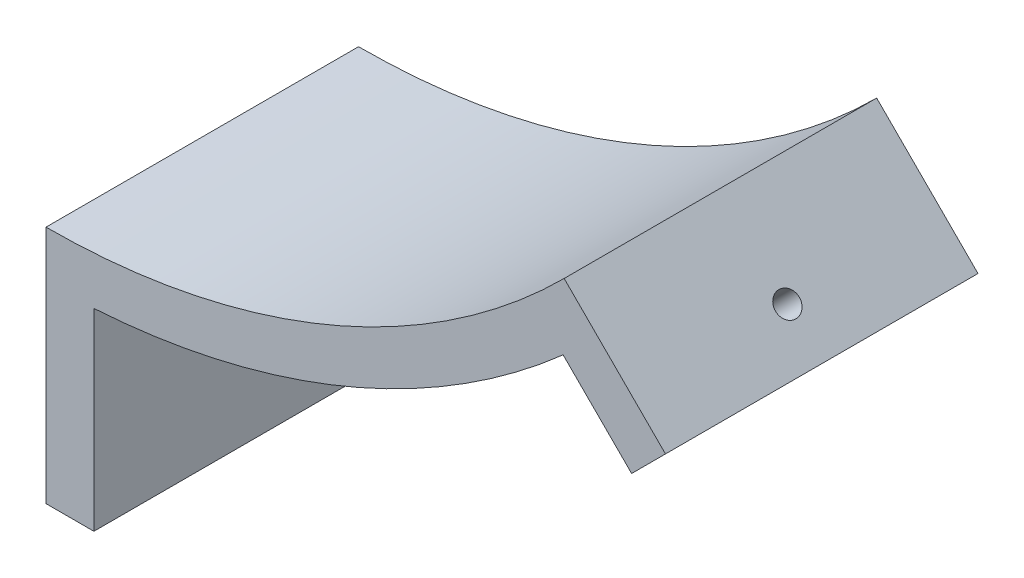
ISO-10303-21;
HEADER;
FILE_DESCRIPTION(('STEP AP214'),'2;1');
FILE_NAME('part.step','',(''),(''),'','','');
FILE_SCHEMA(('AUTOMOTIVE_DESIGN { 1 0 10303 214 1 1 1 1 }'));
ENDSEC;
DATA;
#1=APPLICATION_CONTEXT('core data for automotive mechanical design processes');
#2=APPLICATION_PROTOCOL_DEFINITION('international standard','automotive_design',2000,#1);
#3=PRODUCT_CONTEXT('',#1,'mechanical');
#4=PRODUCT('Part','Part','',(#3));
#5=PRODUCT_RELATED_PRODUCT_CATEGORY('part','',(#4));
#6=PRODUCT_DEFINITION_FORMATION('','',#4);
#7=PRODUCT_DEFINITION_CONTEXT('part definition',#1,'design');
#8=PRODUCT_DEFINITION('design','',#6,#7);
#9=PRODUCT_DEFINITION_SHAPE('','',#8);
#10=(LENGTH_UNIT() NAMED_UNIT(*) SI_UNIT(.MILLI.,.METRE.));
#11=(NAMED_UNIT(*) PLANE_ANGLE_UNIT() SI_UNIT($,.RADIAN.));
#12=(NAMED_UNIT(*) SI_UNIT($,.STERADIAN.) SOLID_ANGLE_UNIT());
#13=UNCERTAINTY_MEASURE_WITH_UNIT(LENGTH_MEASURE(1.E-05),#10,'distance_accuracy_value','');
#14=(GEOMETRIC_REPRESENTATION_CONTEXT(3) GLOBAL_UNCERTAINTY_ASSIGNED_CONTEXT((#13)) GLOBAL_UNIT_ASSIGNED_CONTEXT((#10,
#11,#12)) REPRESENTATION_CONTEXT('',''));
#15=CARTESIAN_POINT('',(0.,0.,0.));
#16=DIRECTION('',(0.,0.,1.));
#17=DIRECTION('',(1.,0.,0.));
#18=AXIS2_PLACEMENT_3D('',#15,#16,#17);
#19=CARTESIAN_POINT('',(9.99999999999998,0.,65.25));
#20=DIRECTION('',(-1.,0.,0.));
#21=DIRECTION('',(0.,-1.,0.));
#22=AXIS2_PLACEMENT_3D('',#19,#20,#21);
#23=PLANE('',#22);
#24=CARTESIAN_POINT('',(9.99999999999998,-183.,32.625));
#25=DIRECTION('',(1.,0.,0.));
#26=DIRECTION('',(0.,0.,-1.));
#27=AXIS2_PLACEMENT_3D('',#24,#25,#26);
#28=CIRCLE('',#27,2.5);
#29=CARTESIAN_POINT('',(9.99999999999998,-183.,30.125));
#30=VERTEX_POINT('',#29);
#31=EDGE_CURVE('E179',#30,#30,#28,.T.);
#32=ORIENTED_EDGE('',*,*,#31,.F.);
#33=EDGE_LOOP('',(#32));
#34=FACE_BOUND('',#33,.T.);
#35=DIRECTION('',(0.,1.,0.));
#36=VECTOR('',#35,1.);
#37=CARTESIAN_POINT('',(9.99999999999998,0.,0.));
#38=LINE('',#37,#36);
#39=CARTESIAN_POINT('',(10.,-203.,0.));
#40=VERTEX_POINT('',#39);
#41=CARTESIAN_POINT('',(10.,-162.692962355475,0.));
#42=VERTEX_POINT('',#41);
#43=EDGE_CURVE('E133',#40,#42,#38,.T.);
#44=ORIENTED_EDGE('',*,*,#43,.T.);
#45=DIRECTION('',(0.,0.,-1.));
#46=VECTOR('',#45,1.);
#47=CARTESIAN_POINT('',(10.,-162.692962355475,65.25));
#48=LINE('',#47,#46);
#49=CARTESIAN_POINT('',(10.,-162.692962355475,65.25));
#50=VERTEX_POINT('',#49);
#51=EDGE_CURVE('E11',#50,#42,#48,.T.);
#52=ORIENTED_EDGE('',*,*,#51,.F.);
#53=DIRECTION('',(0.,1.,0.));
#54=VECTOR('',#53,1.);
#55=CARTESIAN_POINT('',(9.99999999999998,0.,65.25));
#56=LINE('',#55,#54);
#57=CARTESIAN_POINT('',(10.,-203.,65.25));
#58=VERTEX_POINT('',#57);
#59=EDGE_CURVE('E151',#58,#50,#56,.T.);
#60=ORIENTED_EDGE('',*,*,#59,.F.);
#61=DIRECTION('',(0.,0.,-1.));
#62=VECTOR('',#61,1.);
#63=CARTESIAN_POINT('',(10.,-203.,65.25));
#64=LINE('',#63,#62);
#65=EDGE_CURVE('E132',#58,#40,#64,.T.);
#66=ORIENTED_EDGE('',*,*,#65,.T.);
#67=EDGE_LOOP('',(#44,#52,#60,#66));
#68=FACE_BOUND('',#67,.T.);
#69=ADVANCED_FACE('F34',(#34,#68),#23,.F.);
#70=CARTESIAN_POINT('',(0.,0.,65.25));
#71=DIRECTION('',(0.,0.,-1.));
#72=DIRECTION('',(-1.,0.,0.));
#73=AXIS2_PLACEMENT_3D('',#70,#71,#72);
#74=CYLINDRICAL_SURFACE('',#73,163.);
#75=CARTESIAN_POINT('',(0.,0.,0.));
#76=DIRECTION('',(0.,0.,1.));
#77=DIRECTION('',(1.,0.,0.));
#78=AXIS2_PLACEMENT_3D('',#75,#76,#77);
#79=CIRCLE('',#78,163.);
#80=CARTESIAN_POINT('',(107.970229121018,-122.11236474475,0.));
#81=VERTEX_POINT('',#80);
#82=EDGE_CURVE('E136',#42,#81,#79,.T.);
#83=ORIENTED_EDGE('',*,*,#82,.T.);
#84=DIRECTION('',(0.,0.,-1.));
#85=VECTOR('',#84,1.);
#86=CARTESIAN_POINT('',(107.970229121018,-122.11236474475,65.25));
#87=LINE('',#86,#85);
#88=CARTESIAN_POINT('',(107.970229121018,-122.11236474475,65.25));
#89=VERTEX_POINT('',#88);
#90=EDGE_CURVE('E43',#89,#81,#87,.T.);
#91=ORIENTED_EDGE('',*,*,#90,.F.);
#92=CARTESIAN_POINT('',(0.,0.,65.25));
#93=DIRECTION('',(0.,0.,1.));
#94=DIRECTION('',(1.,0.,0.));
#95=AXIS2_PLACEMENT_3D('',#92,#93,#94);
#96=CIRCLE('',#95,163.);
#97=EDGE_CURVE('E93',#50,#89,#96,.T.);
#98=ORIENTED_EDGE('',*,*,#97,.F.);
#99=ORIENTED_EDGE('',*,*,#51,.T.);
#100=EDGE_LOOP('',(#83,#91,#98,#99));
#101=FACE_BOUND('',#100,.T.);
#102=ADVANCED_FACE('F165',(#101),#74,.T.);
#103=CARTESIAN_POINT('',(-7.07106781186535,-7.07106781186532,65.25));
#104=DIRECTION('',(-0.707106781186549,-0.707106781186546,0.));
#105=DIRECTION('',(0.707106781186546,-0.707106781186549,0.));
#106=AXIS2_PLACEMENT_3D('',#103,#104,#105);
#107=PLANE('',#106);
#108=CARTESIAN_POINT('',(115.094553721994,-129.236689345725,32.62));
#109=DIRECTION('',(-0.707106781186549,-0.707106781186546,0.));
#110=DIRECTION('',(0.707106781186546,-0.707106781186549,0.));
#111=AXIS2_PLACEMENT_3D('',#108,#109,#110);
#112=CIRCLE('',#111,2.5);
#113=CARTESIAN_POINT('',(116.86232067496,-131.004456298691,32.62));
#114=VERTEX_POINT('',#113);
#115=EDGE_CURVE('E182',#114,#114,#112,.T.);
#116=ORIENTED_EDGE('',*,*,#115,.F.);
#117=EDGE_LOOP('',(#116));
#118=FACE_BOUND('',#117,.T.);
#119=DIRECTION('',(-0.707106781186546,0.707106781186549,0.));
#120=VECTOR('',#119,1.);
#121=CARTESIAN_POINT('',(-7.07106781186535,-7.07106781186532,0.));
#122=LINE('',#121,#120);
#123=CARTESIAN_POINT('',(122.271687551037,-136.413823174768,0.));
#124=VERTEX_POINT('',#123);
#125=EDGE_CURVE('E139',#124,#81,#122,.T.);
#126=ORIENTED_EDGE('',*,*,#125,.F.);
#127=DIRECTION('',(0.,0.,-1.));
#128=VECTOR('',#127,1.);
#129=CARTESIAN_POINT('',(122.271687551037,-136.413823174768,65.25));
#130=LINE('',#129,#128);
#131=CARTESIAN_POINT('',(122.271687551037,-136.413823174768,65.25));
#132=VERTEX_POINT('',#131);
#133=EDGE_CURVE('E157',#132,#124,#130,.T.);
#134=ORIENTED_EDGE('',*,*,#133,.F.);
#135=DIRECTION('',(-0.707106781186546,0.707106781186549,0.));
#136=VECTOR('',#135,1.);
#137=CARTESIAN_POINT('',(-7.07106781186535,-7.07106781186532,65.25));
#138=LINE('',#137,#136);
#139=EDGE_CURVE('E164',#132,#89,#138,.T.);
#140=ORIENTED_EDGE('',*,*,#139,.T.);
#141=ORIENTED_EDGE('',*,*,#90,.T.);
#142=EDGE_LOOP('',(#126,#134,#140,#141));
#143=FACE_BOUND('',#142,.T.);
#144=ADVANCED_FACE('F162',(#118,#143),#107,.T.);
#145=CARTESIAN_POINT('',(129.342755362902,-129.342755362903,65.25));
#146=DIRECTION('',(0.707106781186546,-0.70710678118655,0.));
#147=DIRECTION('',(0.70710678118655,0.707106781186546,0.));
#148=AXIS2_PLACEMENT_3D('',#145,#146,#147);
#149=PLANE('',#148);
#150=DIRECTION('',(-0.70710678118655,-0.707106781186546,0.));
#151=VECTOR('',#150,1.);
#152=CARTESIAN_POINT('',(129.342755362902,-129.342755362903,0.));
#153=LINE('',#152,#151);
#154=CARTESIAN_POINT('',(129.342755362902,-129.342755362903,0.));
#155=VERTEX_POINT('',#154);
#156=EDGE_CURVE('E142',#155,#124,#153,.T.);
#157=ORIENTED_EDGE('',*,*,#156,.F.);
#158=DIRECTION('',(0.,0.,-1.));
#159=VECTOR('',#158,1.);
#160=CARTESIAN_POINT('',(129.342755362902,-129.342755362903,65.25));
#161=LINE('',#160,#159);
#162=CARTESIAN_POINT('',(129.342755362902,-129.342755362903,65.25));
#163=VERTEX_POINT('',#162);
#164=EDGE_CURVE('E155',#163,#155,#161,.T.);
#165=ORIENTED_EDGE('',*,*,#164,.F.);
#166=DIRECTION('',(-0.70710678118655,-0.707106781186546,0.));
#167=VECTOR('',#166,1.);
#168=CARTESIAN_POINT('',(129.342755362902,-129.342755362903,65.25));
#169=LINE('',#168,#167);
#170=EDGE_CURVE('E127',#163,#132,#169,.T.);
#171=ORIENTED_EDGE('',*,*,#170,.T.);
#172=ORIENTED_EDGE('',*,*,#133,.T.);
#173=EDGE_LOOP('',(#157,#165,#171,#172));
#174=FACE_BOUND('',#173,.T.);
#175=ADVANCED_FACE('F173',(#174),#149,.T.);
#176=CARTESIAN_POINT('',(0.,0.,65.25));
#177=DIRECTION('',(0.707106781186548,0.707106781186547,0.));
#178=DIRECTION('',(-0.707106781186547,0.707106781186548,0.));
#179=AXIS2_PLACEMENT_3D('',#176,#177,#178);
#180=PLANE('',#179);
#181=CARTESIAN_POINT('',(122.165621533859,-122.165621533859,32.62));
#182=DIRECTION('',(0.707106781186549,0.707106781186546,0.));
#183=DIRECTION('',(-0.707106781186546,0.707106781186549,0.));
#184=AXIS2_PLACEMENT_3D('',#181,#182,#183);
#185=CIRCLE('',#184,2.5);
#186=CARTESIAN_POINT('',(120.397854580893,-120.397854580893,32.62));
#187=VERTEX_POINT('',#186);
#188=EDGE_CURVE('E185',#187,#187,#185,.T.);
#189=ORIENTED_EDGE('',*,*,#188,.F.);
#190=EDGE_LOOP('',(#189));
#191=FACE_BOUND('',#190,.T.);
#192=DIRECTION('',(0.707106781186547,-0.707106781186548,0.));
#193=VECTOR('',#192,1.);
#194=CARTESIAN_POINT('',(0.,0.,0.));
#195=LINE('',#194,#193);
#196=CARTESIAN_POINT('',(108.187337521542,-108.187337521542,0.));
#197=VERTEX_POINT('',#196);
#198=EDGE_CURVE('E145',#197,#155,#195,.T.);
#199=ORIENTED_EDGE('',*,*,#198,.F.);
#200=DIRECTION('',(0.,0.,-1.));
#201=VECTOR('',#200,1.);
#202=CARTESIAN_POINT('',(108.187337521542,-108.187337521542,65.25));
#203=LINE('',#202,#201);
#204=CARTESIAN_POINT('',(108.187337521542,-108.187337521542,65.25));
#205=VERTEX_POINT('',#204);
#206=EDGE_CURVE('E115',#205,#197,#203,.T.);
#207=ORIENTED_EDGE('',*,*,#206,.F.);
#208=DIRECTION('',(0.707106781186547,-0.707106781186548,0.));
#209=VECTOR('',#208,1.);
#210=CARTESIAN_POINT('',(0.,0.,65.25));
#211=LINE('',#210,#209);
#212=EDGE_CURVE('E125',#205,#163,#211,.T.);
#213=ORIENTED_EDGE('',*,*,#212,.T.);
#214=ORIENTED_EDGE('',*,*,#164,.T.);
#215=EDGE_LOOP('',(#199,#207,#213,#214));
#216=FACE_BOUND('',#215,.T.);
#217=ADVANCED_FACE('F191',(#191,#216),#180,.T.);
#218=CARTESIAN_POINT('',(0.,0.,65.25));
#219=DIRECTION('',(0.,0.,-1.));
#220=DIRECTION('',(-1.,0.,0.));
#221=AXIS2_PLACEMENT_3D('',#218,#219,#220);
#222=CYLINDRICAL_SURFACE('',#221,153.);
#223=CARTESIAN_POINT('',(0.,0.,0.));
#224=DIRECTION('',(0.,0.,1.));
#225=DIRECTION('',(1.,0.,0.));
#226=AXIS2_PLACEMENT_3D('',#223,#224,#225);
#227=CIRCLE('',#226,153.);
#228=CARTESIAN_POINT('',(0.,-153.,0.));
#229=VERTEX_POINT('',#228);
#230=EDGE_CURVE('E114',#229,#197,#227,.T.);
#231=ORIENTED_EDGE('',*,*,#230,.F.);
#232=DIRECTION('',(0.,0.,-1.));
#233=VECTOR('',#232,1.);
#234=CARTESIAN_POINT('',(0.,-153.,65.25));
#235=LINE('',#234,#233);
#236=CARTESIAN_POINT('',(0.,-153.,65.25));
#237=VERTEX_POINT('',#236);
#238=EDGE_CURVE('E108',#237,#229,#235,.T.);
#239=ORIENTED_EDGE('',*,*,#238,.F.);
#240=CARTESIAN_POINT('',(0.,0.,65.25));
#241=DIRECTION('',(0.,0.,1.));
#242=DIRECTION('',(1.,0.,0.));
#243=AXIS2_PLACEMENT_3D('',#240,#241,#242);
#244=CIRCLE('',#243,153.);
#245=EDGE_CURVE('E112',#237,#205,#244,.T.);
#246=ORIENTED_EDGE('',*,*,#245,.T.);
#247=ORIENTED_EDGE('',*,*,#206,.T.);
#248=EDGE_LOOP('',(#231,#239,#246,#247));
#249=FACE_BOUND('',#248,.T.);
#250=ADVANCED_FACE('F110',(#249),#222,.F.);
#251=CARTESIAN_POINT('',(0.,0.,65.25));
#252=DIRECTION('',(1.,0.,0.));
#253=DIRECTION('',(0.,1.,0.));
#254=AXIS2_PLACEMENT_3D('',#251,#252,#253);
#255=PLANE('',#254);
#256=CARTESIAN_POINT('',(0.,-183.,32.625));
#257=DIRECTION('',(1.,0.,0.));
#258=DIRECTION('',(0.,1.,0.));
#259=AXIS2_PLACEMENT_3D('',#256,#257,#258);
#260=CIRCLE('',#259,2.5);
#261=CARTESIAN_POINT('',(0.,-180.5,32.625));
#262=VERTEX_POINT('',#261);
#263=EDGE_CURVE('E37',#262,#262,#260,.T.);
#264=ORIENTED_EDGE('',*,*,#263,.T.);
#265=EDGE_LOOP('',(#264));
#266=FACE_BOUND('',#265,.T.);
#267=DIRECTION('',(0.,-1.,0.));
#268=VECTOR('',#267,1.);
#269=CARTESIAN_POINT('',(0.,0.,0.));
#270=LINE('',#269,#268);
#271=CARTESIAN_POINT('',(0.,-203.,0.));
#272=VERTEX_POINT('',#271);
#273=EDGE_CURVE('E79',#229,#272,#270,.T.);
#274=ORIENTED_EDGE('',*,*,#273,.T.);
#275=DIRECTION('',(0.,0.,-1.));
#276=VECTOR('',#275,1.);
#277=CARTESIAN_POINT('',(0.,-203.,65.25));
#278=LINE('',#277,#276);
#279=CARTESIAN_POINT('',(0.,-203.,65.25));
#280=VERTEX_POINT('',#279);
#281=EDGE_CURVE('E116',#280,#272,#278,.T.);
#282=ORIENTED_EDGE('',*,*,#281,.F.);
#283=DIRECTION('',(0.,-1.,0.));
#284=VECTOR('',#283,1.);
#285=CARTESIAN_POINT('',(0.,0.,65.25));
#286=LINE('',#285,#284);
#287=EDGE_CURVE('E118',#237,#280,#286,.T.);
#288=ORIENTED_EDGE('',*,*,#287,.F.);
#289=ORIENTED_EDGE('',*,*,#238,.T.);
#290=EDGE_LOOP('',(#274,#282,#288,#289));
#291=FACE_BOUND('',#290,.T.);
#292=ADVANCED_FACE('F119',(#266,#291),#255,.F.);
#293=CARTESIAN_POINT('',(0.,-203.,65.25));
#294=DIRECTION('',(0.,1.,0.));
#295=DIRECTION('',(0.,0.,1.));
#296=AXIS2_PLACEMENT_3D('',#293,#294,#295);
#297=PLANE('',#296);
#298=DIRECTION('',(1.,0.,0.));
#299=VECTOR('',#298,1.);
#300=CARTESIAN_POINT('',(0.,-203.,0.));
#301=LINE('',#300,#299);
#302=EDGE_CURVE('E85',#272,#40,#301,.T.);
#303=ORIENTED_EDGE('',*,*,#302,.T.);
#304=ORIENTED_EDGE('',*,*,#65,.F.);
#305=DIRECTION('',(1.,0.,0.));
#306=VECTOR('',#305,1.);
#307=CARTESIAN_POINT('',(0.,-203.,65.25));
#308=LINE('',#307,#306);
#309=EDGE_CURVE('E51',#280,#58,#308,.T.);
#310=ORIENTED_EDGE('',*,*,#309,.F.);
#311=ORIENTED_EDGE('',*,*,#281,.T.);
#312=EDGE_LOOP('',(#303,#304,#310,#311));
#313=FACE_BOUND('',#312,.T.);
#314=ADVANCED_FACE('F197',(#313),#297,.F.);
#315=CARTESIAN_POINT('',(0.,0.,65.25));
#316=DIRECTION('',(0.,0.,1.));
#317=DIRECTION('',(1.,0.,0.));
#318=AXIS2_PLACEMENT_3D('',#315,#316,#317);
#319=PLANE('',#318);
#320=ORIENTED_EDGE('',*,*,#59,.T.);
#321=ORIENTED_EDGE('',*,*,#97,.T.);
#322=ORIENTED_EDGE('',*,*,#139,.F.);
#323=ORIENTED_EDGE('',*,*,#170,.F.);
#324=ORIENTED_EDGE('',*,*,#212,.F.);
#325=ORIENTED_EDGE('',*,*,#245,.F.);
#326=ORIENTED_EDGE('',*,*,#287,.T.);
#327=ORIENTED_EDGE('',*,*,#309,.T.);
#328=EDGE_LOOP('',(#320,#321,#322,#323,#324,#325,#326,#327));
#329=FACE_BOUND('',#328,.T.);
#330=ADVANCED_FACE('F122',(#329),#319,.T.);
#331=CARTESIAN_POINT('',(0.,0.,0.));
#332=DIRECTION('',(0.,0.,1.));
#333=DIRECTION('',(1.,0.,0.));
#334=AXIS2_PLACEMENT_3D('',#331,#332,#333);
#335=PLANE('',#334);
#336=ORIENTED_EDGE('',*,*,#43,.F.);
#337=ORIENTED_EDGE('',*,*,#302,.F.);
#338=ORIENTED_EDGE('',*,*,#273,.F.);
#339=ORIENTED_EDGE('',*,*,#230,.T.);
#340=ORIENTED_EDGE('',*,*,#198,.T.);
#341=ORIENTED_EDGE('',*,*,#156,.T.);
#342=ORIENTED_EDGE('',*,*,#125,.T.);
#343=ORIENTED_EDGE('',*,*,#82,.F.);
#344=EDGE_LOOP('',(#336,#337,#338,#339,#340,#341,#342,#343));
#345=FACE_BOUND('',#344,.T.);
#346=ADVANCED_FACE('F169',(#345),#335,.F.);
#347=CARTESIAN_POINT('',(-35.,-183.,32.625));
#348=DIRECTION('',(1.,0.,0.));
#349=DIRECTION('',(0.,0.,-1.));
#350=AXIS2_PLACEMENT_3D('',#347,#348,#349);
#351=CYLINDRICAL_SURFACE('',#350,2.5);
#352=ORIENTED_EDGE('',*,*,#31,.T.);
#353=EDGE_LOOP('',(#352));
#354=FACE_BOUND('',#353,.T.);
#355=ORIENTED_EDGE('',*,*,#263,.F.);
#356=EDGE_LOOP('',(#355));
#357=FACE_BOUND('',#356,.T.);
#358=ADVANCED_FACE('F215',(#354,#357),#351,.F.);
#359=CARTESIAN_POINT('',(113.68034015962,-130.650902908098,32.62));
#360=DIRECTION('',(0.707106781186548,0.707106781186546,0.));
#361=DIRECTION('',(-0.707106781186546,0.707106781186549,0.));
#362=AXIS2_PLACEMENT_3D('',#359,#360,#361);
#363=CYLINDRICAL_SURFACE('',#362,2.5);
#364=ORIENTED_EDGE('',*,*,#115,.T.);
#365=EDGE_LOOP('',(#364));
#366=FACE_BOUND('',#365,.T.);
#367=ORIENTED_EDGE('',*,*,#188,.T.);
#368=EDGE_LOOP('',(#367));
#369=FACE_BOUND('',#368,.T.);
#370=ADVANCED_FACE('F189',(#366,#369),#363,.F.);
#371=CLOSED_SHELL('',(#69,#102,#144,#175,#217,#250,#292,#314,#330,#346,#358,#370));
#372=MANIFOLD_SOLID_BREP('B2',#371);
#373=ADVANCED_BREP_SHAPE_REPRESENTATION('',(#18,#372),#14);
#374=SHAPE_DEFINITION_REPRESENTATION(#9,#373);
ENDSEC;
END-ISO-10303-21;
